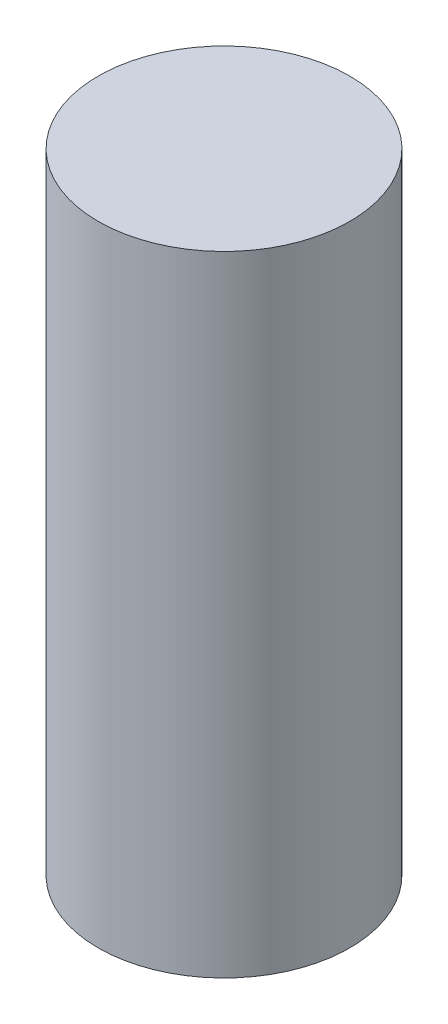
ISO-10303-21;
HEADER;
FILE_DESCRIPTION(('STEP AP214'),'2;1');
FILE_NAME('part.step','',(''),(''),'','','');
FILE_SCHEMA(('AUTOMOTIVE_DESIGN { 1 0 10303 214 1 1 1 1 }'));
ENDSEC;
DATA;
#1=APPLICATION_CONTEXT('core data for automotive mechanical design processes');
#2=APPLICATION_PROTOCOL_DEFINITION('international standard','automotive_design',2000,#1);
#3=PRODUCT_CONTEXT('',#1,'mechanical');
#4=PRODUCT('Part','Part','',(#3));
#5=PRODUCT_RELATED_PRODUCT_CATEGORY('part','',(#4));
#6=PRODUCT_DEFINITION_FORMATION('','',#4);
#7=PRODUCT_DEFINITION_CONTEXT('part definition',#1,'design');
#8=PRODUCT_DEFINITION('design','',#6,#7);
#9=PRODUCT_DEFINITION_SHAPE('','',#8);
#10=(LENGTH_UNIT() NAMED_UNIT(*) SI_UNIT(.MILLI.,.METRE.));
#11=(NAMED_UNIT(*) PLANE_ANGLE_UNIT() SI_UNIT($,.RADIAN.));
#12=(NAMED_UNIT(*) SI_UNIT($,.STERADIAN.) SOLID_ANGLE_UNIT());
#13=UNCERTAINTY_MEASURE_WITH_UNIT(LENGTH_MEASURE(1.E-05),#10,'distance_accuracy_value','');
#14=(GEOMETRIC_REPRESENTATION_CONTEXT(3) GLOBAL_UNCERTAINTY_ASSIGNED_CONTEXT((#13)) GLOBAL_UNIT_ASSIGNED_CONTEXT((#10,
#11,#12)) REPRESENTATION_CONTEXT('',''));
#15=CARTESIAN_POINT('',(0.,0.,0.));
#16=DIRECTION('',(0.,0.,1.));
#17=DIRECTION('',(1.,0.,0.));
#18=AXIS2_PLACEMENT_3D('',#15,#16,#17);
#19=CARTESIAN_POINT('',(0.,15.,0.));
#20=DIRECTION('',(0.,-1.,0.));
#21=DIRECTION('',(0.,0.,-1.));
#22=AXIS2_PLACEMENT_3D('',#19,#20,#21);
#23=CYLINDRICAL_SURFACE('',#22,3.);
#24=CARTESIAN_POINT('',(0.,15.,0.));
#25=DIRECTION('',(0.,1.,0.));
#26=DIRECTION('',(0.,0.,1.));
#27=AXIS2_PLACEMENT_3D('',#24,#25,#26);
#28=CIRCLE('',#27,3.);
#29=CARTESIAN_POINT('',(0.,15.,3.));
#30=VERTEX_POINT('',#29);
#31=EDGE_CURVE('E12',#30,#30,#28,.T.);
#32=ORIENTED_EDGE('',*,*,#31,.F.);
#33=EDGE_LOOP('',(#32));
#34=FACE_BOUND('',#33,.T.);
#35=CARTESIAN_POINT('',(0.,0.,0.));
#36=DIRECTION('',(0.,1.,0.));
#37=DIRECTION('',(0.,0.,1.));
#38=AXIS2_PLACEMENT_3D('',#35,#36,#37);
#39=CIRCLE('',#38,3.);
#40=CARTESIAN_POINT('',(0.,0.,3.));
#41=VERTEX_POINT('',#40);
#42=EDGE_CURVE('E45',#41,#41,#39,.T.);
#43=ORIENTED_EDGE('',*,*,#42,.T.);
#44=EDGE_LOOP('',(#43));
#45=FACE_BOUND('',#44,.T.);
#46=ADVANCED_FACE('F42',(#34,#45),#23,.T.);
#47=CARTESIAN_POINT('',(0.,15.,0.));
#48=DIRECTION('',(0.,1.,0.));
#49=DIRECTION('',(0.,0.,1.));
#50=AXIS2_PLACEMENT_3D('',#47,#48,#49);
#51=PLANE('',#50);
#52=ORIENTED_EDGE('',*,*,#31,.T.);
#53=EDGE_LOOP('',(#52));
#54=FACE_BOUND('',#53,.T.);
#55=ADVANCED_FACE('F57',(#54),#51,.T.);
#56=CARTESIAN_POINT('',(0.,0.,0.));
#57=DIRECTION('',(0.,1.,0.));
#58=DIRECTION('',(0.,0.,1.));
#59=AXIS2_PLACEMENT_3D('',#56,#57,#58);
#60=PLANE('',#59);
#61=ORIENTED_EDGE('',*,*,#42,.F.);
#62=EDGE_LOOP('',(#61));
#63=FACE_BOUND('',#62,.T.);
#64=ADVANCED_FACE('F55',(#63),#60,.F.);
#65=CLOSED_SHELL('',(#46,#55,#64));
#66=MANIFOLD_SOLID_BREP('B2',#65);
#67=ADVANCED_BREP_SHAPE_REPRESENTATION('',(#18,#66),#14);
#68=SHAPE_DEFINITION_REPRESENTATION(#9,#67);
ENDSEC;
END-ISO-10303-21;
